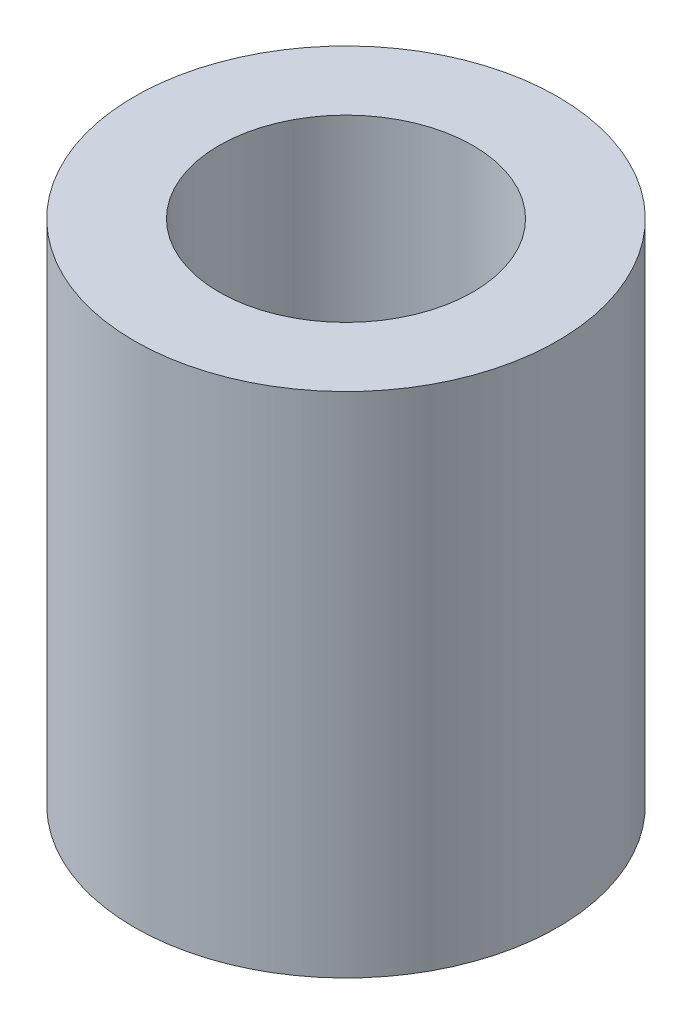
ISO-10303-21;
HEADER;
FILE_DESCRIPTION(('STEP AP214'),'2;1');
FILE_NAME('part.step','',(''),(''),'','','');
FILE_SCHEMA(('AUTOMOTIVE_DESIGN { 1 0 10303 214 1 1 1 1 }'));
ENDSEC;
DATA;
#1=APPLICATION_CONTEXT('core data for automotive mechanical design processes');
#2=APPLICATION_PROTOCOL_DEFINITION('international standard','automotive_design',2000,#1);
#3=PRODUCT_CONTEXT('',#1,'mechanical');
#4=PRODUCT('Part','Part','',(#3));
#5=PRODUCT_RELATED_PRODUCT_CATEGORY('part','',(#4));
#6=PRODUCT_DEFINITION_FORMATION('','',#4);
#7=PRODUCT_DEFINITION_CONTEXT('part definition',#1,'design');
#8=PRODUCT_DEFINITION('design','',#6,#7);
#9=PRODUCT_DEFINITION_SHAPE('','',#8);
#10=(LENGTH_UNIT() NAMED_UNIT(*) SI_UNIT(.MILLI.,.METRE.));
#11=(NAMED_UNIT(*) PLANE_ANGLE_UNIT() SI_UNIT($,.RADIAN.));
#12=(NAMED_UNIT(*) SI_UNIT($,.STERADIAN.) SOLID_ANGLE_UNIT());
#13=UNCERTAINTY_MEASURE_WITH_UNIT(LENGTH_MEASURE(1.E-05),#10,'distance_accuracy_value','');
#14=(GEOMETRIC_REPRESENTATION_CONTEXT(3) GLOBAL_UNCERTAINTY_ASSIGNED_CONTEXT((#13)) GLOBAL_UNIT_ASSIGNED_CONTEXT((#10,
#11,#12)) REPRESENTATION_CONTEXT('',''));
#15=CARTESIAN_POINT('',(0.,0.,0.));
#16=DIRECTION('',(0.,0.,1.));
#17=DIRECTION('',(1.,0.,0.));
#18=AXIS2_PLACEMENT_3D('',#15,#16,#17);
#19=CARTESIAN_POINT('',(0.,12.,0.));
#20=DIRECTION('',(0.,1.,0.));
#21=DIRECTION('',(0.,0.,1.));
#22=AXIS2_PLACEMENT_3D('',#19,#20,#21);
#23=PLANE('',#22);
#24=CARTESIAN_POINT('',(0.,12.,0.));
#25=DIRECTION('',(0.,1.,0.));
#26=DIRECTION('',(0.,0.,1.));
#27=AXIS2_PLACEMENT_3D('',#24,#25,#26);
#28=CIRCLE('',#27,5.);
#29=CARTESIAN_POINT('',(0.,12.,5.));
#30=VERTEX_POINT('',#29);
#31=EDGE_CURVE('E10',#30,#30,#28,.T.);
#32=ORIENTED_EDGE('',*,*,#31,.T.);
#33=EDGE_LOOP('',(#32));
#34=FACE_BOUND('',#33,.T.);
#35=CARTESIAN_POINT('',(0.,12.,0.));
#36=DIRECTION('',(0.,1.,0.));
#37=DIRECTION('',(0.,0.,1.));
#38=AXIS2_PLACEMENT_3D('',#35,#36,#37);
#39=CIRCLE('',#38,3.);
#40=CARTESIAN_POINT('',(0.,12.,3.));
#41=VERTEX_POINT('',#40);
#42=EDGE_CURVE('E42',#41,#41,#39,.T.);
#43=ORIENTED_EDGE('',*,*,#42,.F.);
#44=EDGE_LOOP('',(#43));
#45=FACE_BOUND('',#44,.T.);
#46=ADVANCED_FACE('F31',(#34,#45),#23,.T.);
#47=CARTESIAN_POINT('',(0.,0.,0.));
#48=DIRECTION('',(0.,1.,0.));
#49=DIRECTION('',(0.,0.,1.));
#50=AXIS2_PLACEMENT_3D('',#47,#48,#49);
#51=PLANE('',#50);
#52=CARTESIAN_POINT('',(0.,0.,0.));
#53=DIRECTION('',(0.,1.,0.));
#54=DIRECTION('',(0.,0.,1.));
#55=AXIS2_PLACEMENT_3D('',#52,#53,#54);
#56=CIRCLE('',#55,5.);
#57=CARTESIAN_POINT('',(0.,0.,5.));
#58=VERTEX_POINT('',#57);
#59=EDGE_CURVE('E35',#58,#58,#56,.T.);
#60=ORIENTED_EDGE('',*,*,#59,.F.);
#61=EDGE_LOOP('',(#60));
#62=FACE_BOUND('',#61,.T.);
#63=CARTESIAN_POINT('',(0.,0.,0.));
#64=DIRECTION('',(0.,1.,0.));
#65=DIRECTION('',(0.,0.,1.));
#66=AXIS2_PLACEMENT_3D('',#63,#64,#65);
#67=CIRCLE('',#66,3.);
#68=CARTESIAN_POINT('',(0.,0.,3.));
#69=VERTEX_POINT('',#68);
#70=EDGE_CURVE('E44',#69,#69,#67,.T.);
#71=ORIENTED_EDGE('',*,*,#70,.T.);
#72=EDGE_LOOP('',(#71));
#73=FACE_BOUND('',#72,.T.);
#74=ADVANCED_FACE('F54',(#62,#73),#51,.F.);
#75=CARTESIAN_POINT('',(0.,12.,0.));
#76=DIRECTION('',(0.,-1.,0.));
#77=DIRECTION('',(0.,0.,-1.));
#78=AXIS2_PLACEMENT_3D('',#75,#76,#77);
#79=CYLINDRICAL_SURFACE('',#78,5.);
#80=ORIENTED_EDGE('',*,*,#31,.F.);
#81=EDGE_LOOP('',(#80));
#82=FACE_BOUND('',#81,.T.);
#83=ORIENTED_EDGE('',*,*,#59,.T.);
#84=EDGE_LOOP('',(#83));
#85=FACE_BOUND('',#84,.T.);
#86=ADVANCED_FACE('F33',(#82,#85),#79,.T.);
#87=CARTESIAN_POINT('',(0.,12.,0.));
#88=DIRECTION('',(0.,-1.,0.));
#89=DIRECTION('',(0.,0.,-1.));
#90=AXIS2_PLACEMENT_3D('',#87,#88,#89);
#91=CYLINDRICAL_SURFACE('',#90,3.);
#92=ORIENTED_EDGE('',*,*,#42,.T.);
#93=EDGE_LOOP('',(#92));
#94=FACE_BOUND('',#93,.T.);
#95=ORIENTED_EDGE('',*,*,#70,.F.);
#96=EDGE_LOOP('',(#95));
#97=FACE_BOUND('',#96,.T.);
#98=ADVANCED_FACE('F50',(#94,#97),#91,.F.);
#99=CLOSED_SHELL('',(#46,#74,#86,#98));
#100=MANIFOLD_SOLID_BREP('B2',#99);
#101=ADVANCED_BREP_SHAPE_REPRESENTATION('',(#18,#100),#14);
#102=SHAPE_DEFINITION_REPRESENTATION(#9,#101);
ENDSEC;
END-ISO-10303-21;
